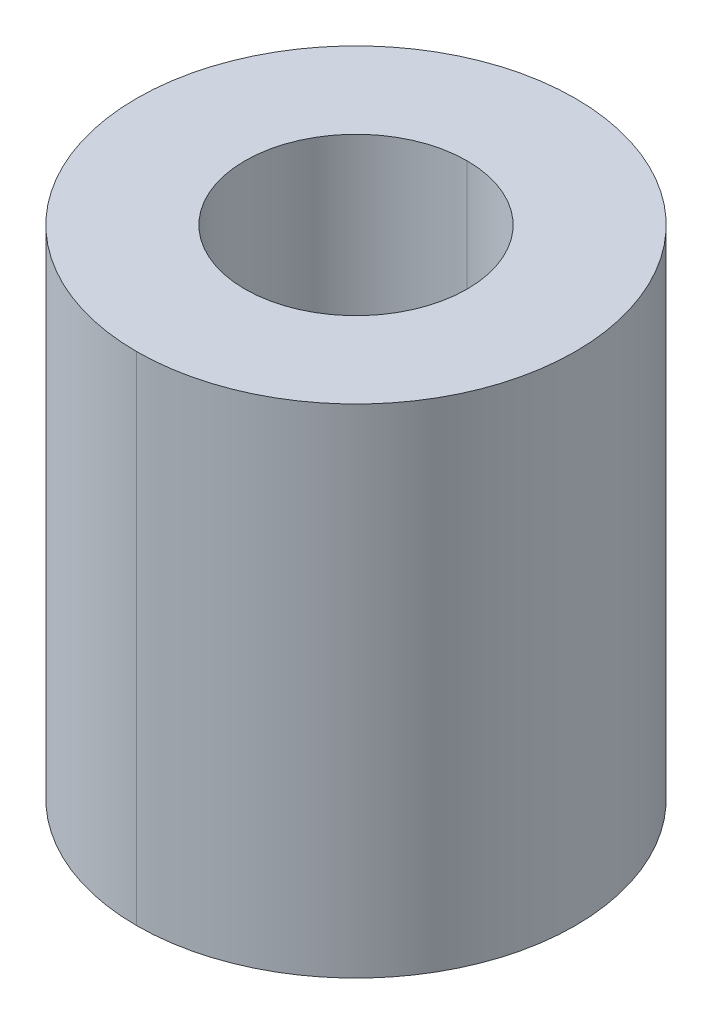
ISO-10303-21;
HEADER;
FILE_DESCRIPTION(('STEP AP214'),'2;1');
FILE_NAME('part.step','',(''),(''),'','','');
FILE_SCHEMA(('AUTOMOTIVE_DESIGN { 1 0 10303 214 1 1 1 1 }'));
ENDSEC;
DATA;
#1=APPLICATION_CONTEXT('core data for automotive mechanical design processes');
#2=APPLICATION_PROTOCOL_DEFINITION('international standard','automotive_design',2000,#1);
#3=PRODUCT_CONTEXT('',#1,'mechanical');
#4=PRODUCT('Part','Part','',(#3));
#5=PRODUCT_RELATED_PRODUCT_CATEGORY('part','',(#4));
#6=PRODUCT_DEFINITION_FORMATION('','',#4);
#7=PRODUCT_DEFINITION_CONTEXT('part definition',#1,'design');
#8=PRODUCT_DEFINITION('design','',#6,#7);
#9=PRODUCT_DEFINITION_SHAPE('','',#8);
#10=(LENGTH_UNIT() NAMED_UNIT(*) SI_UNIT(.MILLI.,.METRE.));
#11=(NAMED_UNIT(*) PLANE_ANGLE_UNIT() SI_UNIT($,.RADIAN.));
#12=(NAMED_UNIT(*) SI_UNIT($,.STERADIAN.) SOLID_ANGLE_UNIT());
#13=UNCERTAINTY_MEASURE_WITH_UNIT(LENGTH_MEASURE(1.E-05),#10,'distance_accuracy_value','');
#14=(GEOMETRIC_REPRESENTATION_CONTEXT(3) GLOBAL_UNCERTAINTY_ASSIGNED_CONTEXT((#13)) GLOBAL_UNIT_ASSIGNED_CONTEXT((#10,
#11,#12)) REPRESENTATION_CONTEXT('',''));
#15=CARTESIAN_POINT('',(0.,0.,0.));
#16=DIRECTION('',(0.,0.,1.));
#17=DIRECTION('',(1.,0.,0.));
#18=AXIS2_PLACEMENT_3D('',#15,#16,#17);
#19=CARTESIAN_POINT('',(0.,21.59,0.));
#20=DIRECTION('',(0.,-1.,0.));
#21=DIRECTION('',(0.,0.,-1.));
#22=AXIS2_PLACEMENT_3D('',#19,#20,#21);
#23=CYLINDRICAL_SURFACE('',#22,4.826);
#24=DIRECTION('',(0.,-1.,0.));
#25=VECTOR('',#24,1.);
#26=CARTESIAN_POINT('',(0.,21.59,4.826));
#27=LINE('',#26,#25);
#28=CARTESIAN_POINT('',(0.,21.59,4.826));
#29=VERTEX_POINT('',#28);
#30=CARTESIAN_POINT('',(0.,0.,4.826));
#31=VERTEX_POINT('',#30);
#32=EDGE_CURVE('E81',#29,#31,#27,.T.);
#33=ORIENTED_EDGE('',*,*,#32,.F.);
#34=CARTESIAN_POINT('',(0.,21.59,0.));
#35=DIRECTION('',(0.,1.,0.));
#36=DIRECTION('',(0.,0.,1.));
#37=AXIS2_PLACEMENT_3D('',#34,#35,#36);
#38=CIRCLE('',#37,4.826);
#39=CARTESIAN_POINT('',(0.,21.59,-4.826));
#40=VERTEX_POINT('',#39);
#41=EDGE_CURVE('E20',#29,#40,#38,.T.);
#42=ORIENTED_EDGE('',*,*,#41,.T.);
#43=DIRECTION('',(0.,-1.,0.));
#44=VECTOR('',#43,1.);
#45=CARTESIAN_POINT('',(0.,21.59,-4.826));
#46=LINE('',#45,#44);
#47=CARTESIAN_POINT('',(0.,0.,-4.826));
#48=VERTEX_POINT('',#47);
#49=EDGE_CURVE('E82',#40,#48,#46,.T.);
#50=ORIENTED_EDGE('',*,*,#49,.T.);
#51=CARTESIAN_POINT('',(0.,0.,0.));
#52=DIRECTION('',(0.,1.,0.));
#53=DIRECTION('',(0.,0.,1.));
#54=AXIS2_PLACEMENT_3D('',#51,#52,#53);
#55=CIRCLE('',#54,4.826);
#56=EDGE_CURVE('E11',#31,#48,#55,.T.);
#57=ORIENTED_EDGE('',*,*,#56,.F.);
#58=EDGE_LOOP('',(#33,#42,#50,#57));
#59=FACE_BOUND('',#58,.T.);
#60=ADVANCED_FACE('F16',(#59),#23,.F.);
#61=CARTESIAN_POINT('',(0.,21.59,0.));
#62=DIRECTION('',(0.,-1.,0.));
#63=DIRECTION('',(0.,0.,-1.));
#64=AXIS2_PLACEMENT_3D('',#61,#62,#63);
#65=CYLINDRICAL_SURFACE('',#64,9.525);
#66=DIRECTION('',(0.,-1.,0.));
#67=VECTOR('',#66,1.);
#68=CARTESIAN_POINT('',(0.,21.59,9.525));
#69=LINE('',#68,#67);
#70=CARTESIAN_POINT('',(0.,21.59,9.525));
#71=VERTEX_POINT('',#70);
#72=CARTESIAN_POINT('',(0.,0.,9.525));
#73=VERTEX_POINT('',#72);
#74=EDGE_CURVE('E112',#71,#73,#69,.T.);
#75=ORIENTED_EDGE('',*,*,#74,.F.);
#76=CARTESIAN_POINT('',(0.,21.59,0.));
#77=DIRECTION('',(0.,1.,0.));
#78=DIRECTION('',(0.,0.,1.));
#79=AXIS2_PLACEMENT_3D('',#76,#77,#78);
#80=CIRCLE('',#79,9.525);
#81=CARTESIAN_POINT('',(0.,21.59,-9.525));
#82=VERTEX_POINT('',#81);
#83=EDGE_CURVE('E53',#82,#71,#80,.T.);
#84=ORIENTED_EDGE('',*,*,#83,.F.);
#85=DIRECTION('',(0.,-1.,0.));
#86=VECTOR('',#85,1.);
#87=CARTESIAN_POINT('',(0.,21.59,-9.525));
#88=LINE('',#87,#86);
#89=CARTESIAN_POINT('',(0.,0.,-9.525));
#90=VERTEX_POINT('',#89);
#91=EDGE_CURVE('E104',#82,#90,#88,.T.);
#92=ORIENTED_EDGE('',*,*,#91,.T.);
#93=CARTESIAN_POINT('',(0.,0.,0.));
#94=DIRECTION('',(0.,1.,0.));
#95=DIRECTION('',(0.,0.,1.));
#96=AXIS2_PLACEMENT_3D('',#93,#94,#95);
#97=CIRCLE('',#96,9.525);
#98=EDGE_CURVE('E30',#90,#73,#97,.T.);
#99=ORIENTED_EDGE('',*,*,#98,.T.);
#100=EDGE_LOOP('',(#75,#84,#92,#99));
#101=FACE_BOUND('',#100,.T.);
#102=ADVANCED_FACE('F18',(#101),#65,.T.);
#103=CARTESIAN_POINT('',(0.,0.,0.));
#104=DIRECTION('',(0.,1.,0.));
#105=DIRECTION('',(1.,0.,0.));
#106=AXIS2_PLACEMENT_3D('',#103,#104,#105);
#107=PLANE('',#106);
#108=CARTESIAN_POINT('',(0.,0.,0.));
#109=DIRECTION('',(0.,1.,0.));
#110=DIRECTION('',(0.,0.,1.));
#111=AXIS2_PLACEMENT_3D('',#108,#109,#110);
#112=CIRCLE('',#111,4.826);
#113=EDGE_CURVE('E95',#48,#31,#112,.T.);
#114=ORIENTED_EDGE('',*,*,#113,.T.);
#115=ORIENTED_EDGE('',*,*,#56,.T.);
#116=EDGE_LOOP('',(#114,#115));
#117=FACE_BOUND('',#116,.T.);
#118=ORIENTED_EDGE('',*,*,#98,.F.);
#119=CARTESIAN_POINT('',(0.,0.,0.));
#120=DIRECTION('',(0.,1.,0.));
#121=DIRECTION('',(0.,0.,1.));
#122=AXIS2_PLACEMENT_3D('',#119,#120,#121);
#123=CIRCLE('',#122,9.525);
#124=EDGE_CURVE('E107',#73,#90,#123,.T.);
#125=ORIENTED_EDGE('',*,*,#124,.F.);
#126=EDGE_LOOP('',(#118,#125));
#127=FACE_BOUND('',#126,.T.);
#128=ADVANCED_FACE('F200',(#117,#127),#107,.F.);
#129=CARTESIAN_POINT('',(0.,21.59,0.));
#130=DIRECTION('',(0.,1.,0.));
#131=DIRECTION('',(1.,0.,0.));
#132=AXIS2_PLACEMENT_3D('',#129,#130,#131);
#133=PLANE('',#132);
#134=CARTESIAN_POINT('',(0.,21.59,0.));
#135=DIRECTION('',(0.,1.,0.));
#136=DIRECTION('',(0.,0.,1.));
#137=AXIS2_PLACEMENT_3D('',#134,#135,#136);
#138=CIRCLE('',#137,4.826);
#139=EDGE_CURVE('E93',#40,#29,#138,.T.);
#140=ORIENTED_EDGE('',*,*,#139,.F.);
#141=ORIENTED_EDGE('',*,*,#41,.F.);
#142=EDGE_LOOP('',(#140,#141));
#143=FACE_BOUND('',#142,.T.);
#144=ORIENTED_EDGE('',*,*,#83,.T.);
#145=CARTESIAN_POINT('',(0.,21.59,0.));
#146=DIRECTION('',(0.,1.,0.));
#147=DIRECTION('',(0.,0.,1.));
#148=AXIS2_PLACEMENT_3D('',#145,#146,#147);
#149=CIRCLE('',#148,9.525);
#150=EDGE_CURVE('E94',#71,#82,#149,.T.);
#151=ORIENTED_EDGE('',*,*,#150,.T.);
#152=EDGE_LOOP('',(#144,#151));
#153=FACE_BOUND('',#152,.T.);
#154=ADVANCED_FACE('F96',(#143,#153),#133,.T.);
#155=CARTESIAN_POINT('',(0.,21.59,0.));
#156=DIRECTION('',(0.,-1.,0.));
#157=DIRECTION('',(0.,0.,-1.));
#158=AXIS2_PLACEMENT_3D('',#155,#156,#157);
#159=CYLINDRICAL_SURFACE('',#158,9.525);
#160=ORIENTED_EDGE('',*,*,#150,.F.);
#161=ORIENTED_EDGE('',*,*,#74,.T.);
#162=ORIENTED_EDGE('',*,*,#124,.T.);
#163=ORIENTED_EDGE('',*,*,#91,.F.);
#164=EDGE_LOOP('',(#160,#161,#162,#163));
#165=FACE_BOUND('',#164,.T.);
#166=ADVANCED_FACE('F177',(#165),#159,.T.);
#167=CARTESIAN_POINT('',(0.,21.59,0.));
#168=DIRECTION('',(0.,-1.,0.));
#169=DIRECTION('',(0.,0.,-1.));
#170=AXIS2_PLACEMENT_3D('',#167,#168,#169);
#171=CYLINDRICAL_SURFACE('',#170,4.826);
#172=ORIENTED_EDGE('',*,*,#139,.T.);
#173=ORIENTED_EDGE('',*,*,#32,.T.);
#174=ORIENTED_EDGE('',*,*,#113,.F.);
#175=ORIENTED_EDGE('',*,*,#49,.F.);
#176=EDGE_LOOP('',(#172,#173,#174,#175));
#177=FACE_BOUND('',#176,.T.);
#178=ADVANCED_FACE('F89',(#177),#171,.F.);
#179=CLOSED_SHELL('',(#60,#102,#128,#154,#166,#178));
#180=MANIFOLD_SOLID_BREP('B1',#179);
#181=ADVANCED_BREP_SHAPE_REPRESENTATION('',(#18,#180),#14);
#182=SHAPE_DEFINITION_REPRESENTATION(#9,#181);
ENDSEC;
END-ISO-10303-21;
